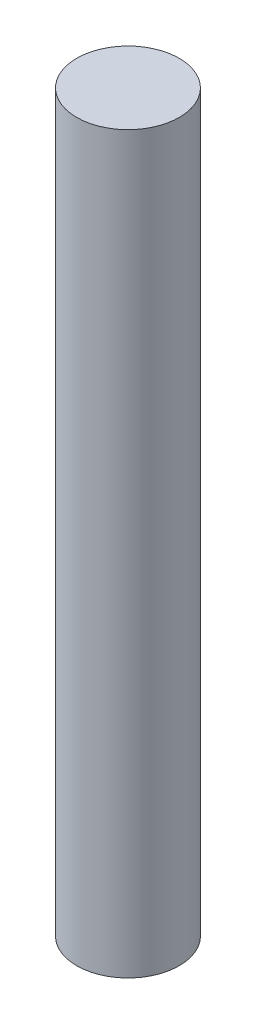
ISO-10303-21;
HEADER;
FILE_DESCRIPTION(('STEP AP214'),'2;1');
FILE_NAME('part.step','',(''),(''),'','','');
FILE_SCHEMA(('AUTOMOTIVE_DESIGN { 1 0 10303 214 1 1 1 1 }'));
ENDSEC;
DATA;
#1=APPLICATION_CONTEXT('core data for automotive mechanical design processes');
#2=APPLICATION_PROTOCOL_DEFINITION('international standard','automotive_design',2000,#1);
#3=PRODUCT_CONTEXT('',#1,'mechanical');
#4=PRODUCT('Part','Part','',(#3));
#5=PRODUCT_RELATED_PRODUCT_CATEGORY('part','',(#4));
#6=PRODUCT_DEFINITION_FORMATION('','',#4);
#7=PRODUCT_DEFINITION_CONTEXT('part definition',#1,'design');
#8=PRODUCT_DEFINITION('design','',#6,#7);
#9=PRODUCT_DEFINITION_SHAPE('','',#8);
#10=(LENGTH_UNIT() NAMED_UNIT(*) SI_UNIT(.MILLI.,.METRE.));
#11=(NAMED_UNIT(*) PLANE_ANGLE_UNIT() SI_UNIT($,.RADIAN.));
#12=(NAMED_UNIT(*) SI_UNIT($,.STERADIAN.) SOLID_ANGLE_UNIT());
#13=UNCERTAINTY_MEASURE_WITH_UNIT(LENGTH_MEASURE(1.E-05),#10,'distance_accuracy_value','');
#14=(GEOMETRIC_REPRESENTATION_CONTEXT(3) GLOBAL_UNCERTAINTY_ASSIGNED_CONTEXT((#13)) GLOBAL_UNIT_ASSIGNED_CONTEXT((#10,
#11,#12)) REPRESENTATION_CONTEXT('',''));
#15=CARTESIAN_POINT('',(0.,0.,0.));
#16=DIRECTION('',(0.,0.,1.));
#17=DIRECTION('',(1.,0.,0.));
#18=AXIS2_PLACEMENT_3D('',#15,#16,#17);
#19=CARTESIAN_POINT('',(0.,43.,0.));
#20=DIRECTION('',(0.,-1.,0.));
#21=DIRECTION('',(0.,0.,-1.));
#22=AXIS2_PLACEMENT_3D('',#19,#20,#21);
#23=CYLINDRICAL_SURFACE('',#22,3.);
#24=CARTESIAN_POINT('',(0.,43.,0.));
#25=DIRECTION('',(0.,1.,0.));
#26=DIRECTION('',(0.,0.,1.));
#27=AXIS2_PLACEMENT_3D('',#24,#25,#26);
#28=CIRCLE('',#27,3.);
#29=CARTESIAN_POINT('',(0.,43.,3.));
#30=VERTEX_POINT('',#29);
#31=EDGE_CURVE('E10',#30,#30,#28,.T.);
#32=ORIENTED_EDGE('',*,*,#31,.F.);
#33=EDGE_LOOP('',(#32));
#34=FACE_BOUND('',#33,.T.);
#35=CARTESIAN_POINT('',(0.,0.,0.));
#36=DIRECTION('',(0.,1.,0.));
#37=DIRECTION('',(0.,0.,1.));
#38=AXIS2_PLACEMENT_3D('',#35,#36,#37);
#39=CIRCLE('',#38,3.);
#40=CARTESIAN_POINT('',(0.,0.,3.));
#41=VERTEX_POINT('',#40);
#42=EDGE_CURVE('E32',#41,#41,#39,.T.);
#43=ORIENTED_EDGE('',*,*,#42,.T.);
#44=EDGE_LOOP('',(#43));
#45=FACE_BOUND('',#44,.T.);
#46=ADVANCED_FACE('F29',(#34,#45),#23,.T.);
#47=CARTESIAN_POINT('',(0.,43.,0.));
#48=DIRECTION('',(0.,1.,0.));
#49=DIRECTION('',(0.,0.,1.));
#50=AXIS2_PLACEMENT_3D('',#47,#48,#49);
#51=PLANE('',#50);
#52=ORIENTED_EDGE('',*,*,#31,.T.);
#53=EDGE_LOOP('',(#52));
#54=FACE_BOUND('',#53,.T.);
#55=ADVANCED_FACE('F44',(#54),#51,.T.);
#56=CARTESIAN_POINT('',(0.,0.,0.));
#57=DIRECTION('',(0.,1.,0.));
#58=DIRECTION('',(0.,0.,1.));
#59=AXIS2_PLACEMENT_3D('',#56,#57,#58);
#60=PLANE('',#59);
#61=ORIENTED_EDGE('',*,*,#42,.F.);
#62=EDGE_LOOP('',(#61));
#63=FACE_BOUND('',#62,.T.);
#64=ADVANCED_FACE('F42',(#63),#60,.F.);
#65=CLOSED_SHELL('',(#46,#55,#64));
#66=MANIFOLD_SOLID_BREP('B2',#65);
#67=ADVANCED_BREP_SHAPE_REPRESENTATION('',(#18,#66),#14);
#68=SHAPE_DEFINITION_REPRESENTATION(#9,#67);
ENDSEC;
END-ISO-10303-21;
